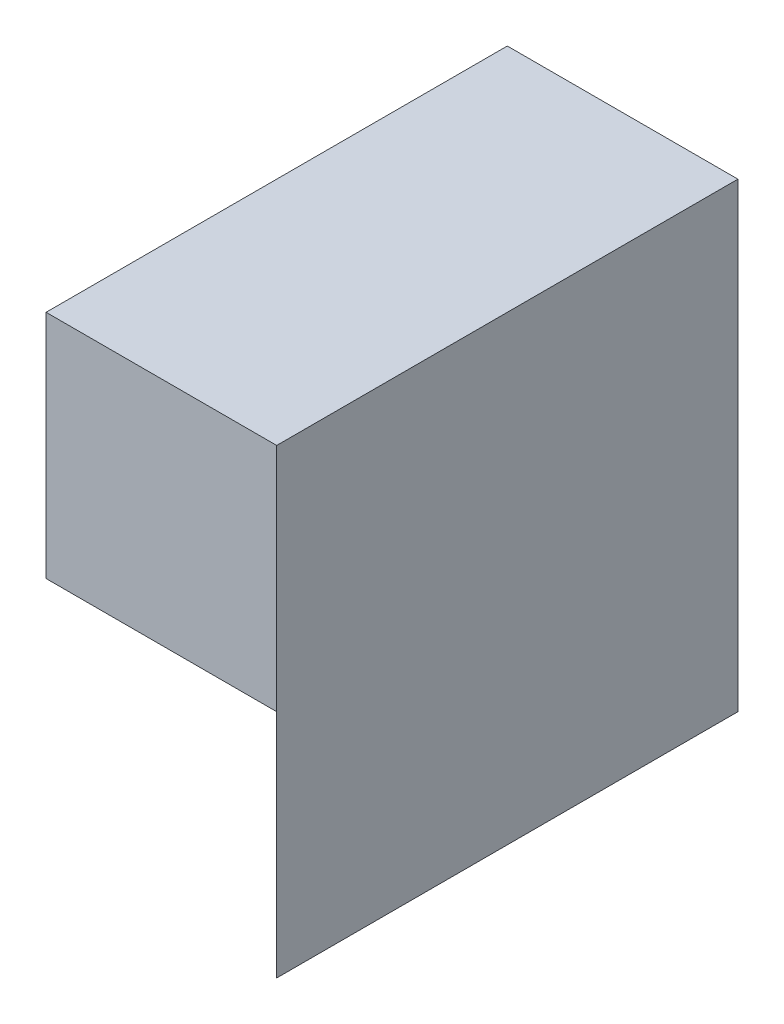
ISO-10303-21;
HEADER;
FILE_DESCRIPTION(('STEP AP214'),'2;1');
FILE_NAME('part.step','',(''),(''),'','','');
FILE_SCHEMA(('AUTOMOTIVE_DESIGN { 1 0 10303 214 1 1 1 1 }'));
ENDSEC;
DATA;
#1=APPLICATION_CONTEXT('core data for automotive mechanical design processes');
#2=APPLICATION_PROTOCOL_DEFINITION('international standard','automotive_design',2000,#1);
#3=PRODUCT_CONTEXT('',#1,'mechanical');
#4=PRODUCT('Part','Part','',(#3));
#5=PRODUCT_RELATED_PRODUCT_CATEGORY('part','',(#4));
#6=PRODUCT_DEFINITION_FORMATION('','',#4);
#7=PRODUCT_DEFINITION_CONTEXT('part definition',#1,'design');
#8=PRODUCT_DEFINITION('design','',#6,#7);
#9=PRODUCT_DEFINITION_SHAPE('','',#8);
#10=(LENGTH_UNIT() NAMED_UNIT(*) SI_UNIT(.MILLI.,.METRE.));
#11=(NAMED_UNIT(*) PLANE_ANGLE_UNIT() SI_UNIT($,.RADIAN.));
#12=(NAMED_UNIT(*) SI_UNIT($,.STERADIAN.) SOLID_ANGLE_UNIT());
#13=UNCERTAINTY_MEASURE_WITH_UNIT(LENGTH_MEASURE(1.E-05),#10,'distance_accuracy_value','');
#14=(GEOMETRIC_REPRESENTATION_CONTEXT(3) GLOBAL_UNCERTAINTY_ASSIGNED_CONTEXT((#13)) GLOBAL_UNIT_ASSIGNED_CONTEXT((#10,
#11,#12)) REPRESENTATION_CONTEXT('',''));
#15=CARTESIAN_POINT('',(0.,0.,0.));
#16=DIRECTION('',(0.,0.,1.));
#17=DIRECTION('',(1.,0.,0.));
#18=AXIS2_PLACEMENT_3D('',#15,#16,#17);
#19=CARTESIAN_POINT('',(0.,20.,40.));
#20=DIRECTION('',(0.,-1.,0.));
#21=DIRECTION('',(0.,0.,-1.));
#22=AXIS2_PLACEMENT_3D('',#19,#20,#21);
#23=PLANE('',#22);
#24=DIRECTION('',(0.,0.,1.));
#25=VECTOR('',#24,1.);
#26=CARTESIAN_POINT('',(20.,20.,0.));
#27=LINE('',#26,#25);
#28=CARTESIAN_POINT('',(20.,20.,0.));
#29=VERTEX_POINT('',#28);
#30=CARTESIAN_POINT('',(20.,20.,20.));
#31=VERTEX_POINT('',#30);
#32=EDGE_CURVE('E50',#29,#31,#27,.T.);
#33=ORIENTED_EDGE('',*,*,#32,.F.);
#34=DIRECTION('',(-1.,0.,0.));
#35=VECTOR('',#34,1.);
#36=CARTESIAN_POINT('',(0.,20.,0.));
#37=LINE('',#36,#35);
#38=CARTESIAN_POINT('',(0.,20.,0.));
#39=VERTEX_POINT('',#38);
#40=EDGE_CURVE('E98',#29,#39,#37,.T.);
#41=ORIENTED_EDGE('',*,*,#40,.T.);
#42=DIRECTION('',(-0.707106781186548,0.,-0.707106781186547));
#43=VECTOR('',#42,1.);
#44=CARTESIAN_POINT('',(0.,20.,0.));
#45=LINE('',#44,#43);
#46=EDGE_CURVE('E57',#31,#39,#45,.T.);
#47=ORIENTED_EDGE('',*,*,#46,.F.);
#48=EDGE_LOOP('',(#33,#41,#47));
#49=FACE_BOUND('',#48,.T.);
#50=ADVANCED_FACE('F33',(#49),#23,.F.);
#51=CARTESIAN_POINT('',(0.,0.,40.));
#52=DIRECTION('',(0.,1.,0.));
#53=DIRECTION('',(0.,0.,1.));
#54=AXIS2_PLACEMENT_3D('',#51,#52,#53);
#55=PLANE('',#54);
#56=DIRECTION('',(0.,0.,-1.));
#57=VECTOR('',#56,1.);
#58=CARTESIAN_POINT('',(40.,0.,40.));
#59=LINE('',#58,#57);
#60=CARTESIAN_POINT('',(40.,0.,40.));
#61=VERTEX_POINT('',#60);
#62=CARTESIAN_POINT('',(40.,0.,0.));
#63=VERTEX_POINT('',#62);
#64=EDGE_CURVE('E11',#61,#63,#59,.T.);
#65=ORIENTED_EDGE('',*,*,#64,.F.);
#66=DIRECTION('',(-0.707106781186548,0.,-0.707106781186547));
#67=VECTOR('',#66,1.);
#68=CARTESIAN_POINT('',(20.,0.,20.));
#69=LINE('',#68,#67);
#70=CARTESIAN_POINT('',(0.,0.,0.));
#71=VERTEX_POINT('',#70);
#72=EDGE_CURVE('E138',#61,#71,#69,.T.);
#73=ORIENTED_EDGE('',*,*,#72,.T.);
#74=DIRECTION('',(1.,0.,0.));
#75=VECTOR('',#74,1.);
#76=CARTESIAN_POINT('',(0.,0.,0.));
#77=LINE('',#76,#75);
#78=EDGE_CURVE('E99',#71,#63,#77,.T.);
#79=ORIENTED_EDGE('',*,*,#78,.T.);
#80=EDGE_LOOP('',(#65,#73,#79));
#81=FACE_BOUND('',#80,.T.);
#82=ADVANCED_FACE('F35',(#81),#55,.F.);
#83=CARTESIAN_POINT('',(40.,0.,40.));
#84=DIRECTION('',(-1.,0.,0.));
#85=DIRECTION('',(0.,0.,1.));
#86=AXIS2_PLACEMENT_3D('',#83,#84,#85);
#87=PLANE('',#86);
#88=DIRECTION('',(0.,1.,0.));
#89=VECTOR('',#88,1.);
#90=CARTESIAN_POINT('',(40.,0.,0.));
#91=LINE('',#90,#89);
#92=CARTESIAN_POINT('',(40.,40.,0.));
#93=VERTEX_POINT('',#92);
#94=EDGE_CURVE('E88',#63,#93,#91,.T.);
#95=ORIENTED_EDGE('',*,*,#94,.T.);
#96=DIRECTION('',(0.,0.,-1.));
#97=VECTOR('',#96,1.);
#98=CARTESIAN_POINT('',(40.,40.,0.));
#99=LINE('',#98,#97);
#100=CARTESIAN_POINT('',(40.,40.,40.));
#101=VERTEX_POINT('',#100);
#102=EDGE_CURVE('E93',#101,#93,#99,.T.);
#103=ORIENTED_EDGE('',*,*,#102,.F.);
#104=DIRECTION('',(0.,-1.,0.));
#105=VECTOR('',#104,1.);
#106=CARTESIAN_POINT('',(40.,40.,40.));
#107=LINE('',#106,#105);
#108=CARTESIAN_POINT('',(40.,20.,40.));
#109=VERTEX_POINT('',#108);
#110=EDGE_CURVE('E121',#101,#109,#107,.T.);
#111=ORIENTED_EDGE('',*,*,#110,.T.);
#112=DIRECTION('',(0.,1.,0.));
#113=VECTOR('',#112,1.);
#114=CARTESIAN_POINT('',(40.,0.,40.));
#115=LINE('',#114,#113);
#116=EDGE_CURVE('E42',#61,#109,#115,.T.);
#117=ORIENTED_EDGE('',*,*,#116,.F.);
#118=ORIENTED_EDGE('',*,*,#64,.T.);
#119=EDGE_LOOP('',(#95,#103,#111,#117,#118));
#120=FACE_BOUND('',#119,.T.);
#121=ADVANCED_FACE('F90',(#120),#87,.F.);
#122=CARTESIAN_POINT('',(0.,0.,0.));
#123=DIRECTION('',(0.,0.,-1.));
#124=DIRECTION('',(-1.,0.,0.));
#125=AXIS2_PLACEMENT_3D('',#122,#123,#124);
#126=PLANE('',#125);
#127=ORIENTED_EDGE('',*,*,#40,.F.);
#128=DIRECTION('',(0.,-1.,0.));
#129=VECTOR('',#128,1.);
#130=CARTESIAN_POINT('',(20.,40.,0.));
#131=LINE('',#130,#129);
#132=CARTESIAN_POINT('',(20.,40.,0.));
#133=VERTEX_POINT('',#132);
#134=EDGE_CURVE('E105',#133,#29,#131,.T.);
#135=ORIENTED_EDGE('',*,*,#134,.F.);
#136=DIRECTION('',(-1.,0.,0.));
#137=VECTOR('',#136,1.);
#138=CARTESIAN_POINT('',(40.,40.,0.));
#139=LINE('',#138,#137);
#140=EDGE_CURVE('E102',#93,#133,#139,.T.);
#141=ORIENTED_EDGE('',*,*,#140,.F.);
#142=ORIENTED_EDGE('',*,*,#94,.F.);
#143=ORIENTED_EDGE('',*,*,#78,.F.);
#144=DIRECTION('',(0.,-1.,0.));
#145=VECTOR('',#144,1.);
#146=CARTESIAN_POINT('',(0.,0.,0.));
#147=LINE('',#146,#145);
#148=EDGE_CURVE('E141',#39,#71,#147,.T.);
#149=ORIENTED_EDGE('',*,*,#148,.F.);
#150=EDGE_LOOP('',(#127,#135,#141,#142,#143,#149));
#151=FACE_BOUND('',#150,.T.);
#152=ADVANCED_FACE('F103',(#151),#126,.T.);
#153=CARTESIAN_POINT('',(0.,-15.,0.));
#154=DIRECTION('',(0.707106781186548,0.,-0.707106781186548));
#155=DIRECTION('',(-0.707106781186548,0.,-0.707106781186547));
#156=AXIS2_PLACEMENT_3D('',#153,#154,#155);
#157=PLANE('',#156);
#158=ORIENTED_EDGE('',*,*,#116,.T.);
#159=EDGE_CURVE('E130',#109,#31,#45,.T.);
#160=ORIENTED_EDGE('',*,*,#159,.T.);
#161=ORIENTED_EDGE('',*,*,#46,.T.);
#162=ORIENTED_EDGE('',*,*,#148,.T.);
#163=ORIENTED_EDGE('',*,*,#72,.F.);
#164=EDGE_LOOP('',(#158,#160,#161,#162,#163));
#165=FACE_BOUND('',#164,.T.);
#166=ADVANCED_FACE('F147',(#165),#157,.F.);
#167=CARTESIAN_POINT('',(0.,20.,0.));
#168=DIRECTION('',(0.,-1.,0.));
#169=DIRECTION('',(0.,0.,-1.));
#170=AXIS2_PLACEMENT_3D('',#167,#168,#169);
#171=PLANE('',#170);
#172=ORIENTED_EDGE('',*,*,#159,.F.);
#173=DIRECTION('',(1.,0.,0.));
#174=VECTOR('',#173,1.);
#175=CARTESIAN_POINT('',(40.,20.,40.));
#176=LINE('',#175,#174);
#177=CARTESIAN_POINT('',(20.,20.,40.));
#178=VERTEX_POINT('',#177);
#179=EDGE_CURVE('E114',#178,#109,#176,.T.);
#180=ORIENTED_EDGE('',*,*,#179,.F.);
#181=EDGE_CURVE('E122',#31,#178,#27,.T.);
#182=ORIENTED_EDGE('',*,*,#181,.F.);
#183=EDGE_LOOP('',(#172,#180,#182));
#184=FACE_BOUND('',#183,.T.);
#185=ADVANCED_FACE('F151',(#184),#171,.T.);
#186=CARTESIAN_POINT('',(20.,40.,0.));
#187=DIRECTION('',(1.,0.,0.));
#188=DIRECTION('',(0.,0.,-1.));
#189=AXIS2_PLACEMENT_3D('',#186,#187,#188);
#190=PLANE('',#189);
#191=ORIENTED_EDGE('',*,*,#32,.T.);
#192=ORIENTED_EDGE('',*,*,#181,.T.);
#193=DIRECTION('',(0.,-1.,0.));
#194=VECTOR('',#193,1.);
#195=CARTESIAN_POINT('',(20.,40.,40.));
#196=LINE('',#195,#194);
#197=CARTESIAN_POINT('',(20.,40.,40.));
#198=VERTEX_POINT('',#197);
#199=EDGE_CURVE('E128',#198,#178,#196,.T.);
#200=ORIENTED_EDGE('',*,*,#199,.F.);
#201=DIRECTION('',(0.,0.,1.));
#202=VECTOR('',#201,1.);
#203=CARTESIAN_POINT('',(20.,40.,0.));
#204=LINE('',#203,#202);
#205=EDGE_CURVE('E108',#133,#198,#204,.T.);
#206=ORIENTED_EDGE('',*,*,#205,.F.);
#207=ORIENTED_EDGE('',*,*,#134,.T.);
#208=EDGE_LOOP('',(#191,#192,#200,#206,#207));
#209=FACE_BOUND('',#208,.T.);
#210=ADVANCED_FACE('F154',(#209),#190,.F.);
#211=CARTESIAN_POINT('',(40.,40.,40.));
#212=DIRECTION('',(0.,0.,-1.));
#213=DIRECTION('',(-1.,0.,0.));
#214=AXIS2_PLACEMENT_3D('',#211,#212,#213);
#215=PLANE('',#214);
#216=ORIENTED_EDGE('',*,*,#179,.T.);
#217=ORIENTED_EDGE('',*,*,#110,.F.);
#218=DIRECTION('',(1.,0.,0.));
#219=VECTOR('',#218,1.);
#220=CARTESIAN_POINT('',(40.,40.,40.));
#221=LINE('',#220,#219);
#222=EDGE_CURVE('E112',#198,#101,#221,.T.);
#223=ORIENTED_EDGE('',*,*,#222,.F.);
#224=ORIENTED_EDGE('',*,*,#199,.T.);
#225=EDGE_LOOP('',(#216,#217,#223,#224));
#226=FACE_BOUND('',#225,.T.);
#227=ADVANCED_FACE('F152',(#226),#215,.F.);
#228=CARTESIAN_POINT('',(0.,40.,0.));
#229=DIRECTION('',(0.,-1.,0.));
#230=DIRECTION('',(0.,0.,-1.));
#231=AXIS2_PLACEMENT_3D('',#228,#229,#230);
#232=PLANE('',#231);
#233=ORIENTED_EDGE('',*,*,#102,.T.);
#234=ORIENTED_EDGE('',*,*,#140,.T.);
#235=ORIENTED_EDGE('',*,*,#205,.T.);
#236=ORIENTED_EDGE('',*,*,#222,.T.);
#237=EDGE_LOOP('',(#233,#234,#235,#236));
#238=FACE_BOUND('',#237,.T.);
#239=ADVANCED_FACE('F110',(#238),#232,.F.);
#240=CLOSED_SHELL('',(#50,#82,#121,#152,#166,#185,#210,#227,#239));
#241=MANIFOLD_SOLID_BREP('B2',#240);
#242=ADVANCED_BREP_SHAPE_REPRESENTATION('',(#18,#241),#14);
#243=SHAPE_DEFINITION_REPRESENTATION(#9,#242);
ENDSEC;
END-ISO-10303-21;
